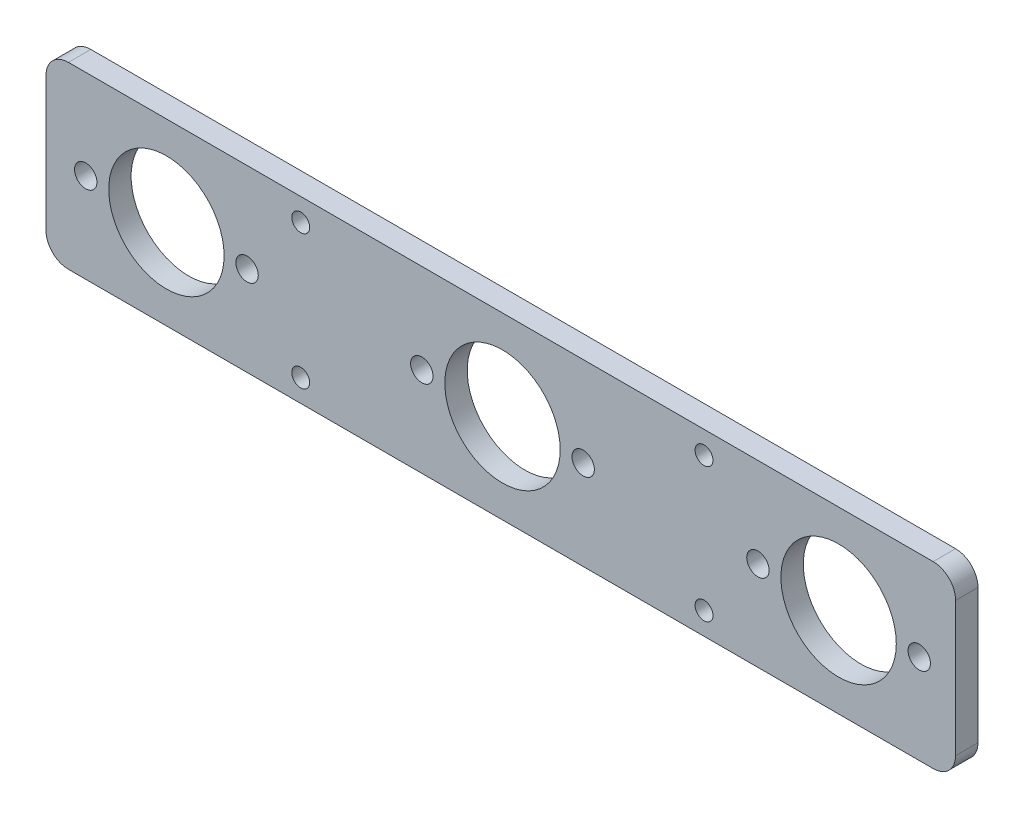
ISO-10303-21;
HEADER;
FILE_DESCRIPTION(('STEP AP214'),'2;1');
FILE_NAME('part.step','',(''),(''),'','','');
FILE_SCHEMA(('AUTOMOTIVE_DESIGN { 1 0 10303 214 1 1 1 1 }'));
ENDSEC;
DATA;
#1=APPLICATION_CONTEXT('core data for automotive mechanical design processes');
#2=APPLICATION_PROTOCOL_DEFINITION('international standard','automotive_design',2000,#1);
#3=PRODUCT_CONTEXT('',#1,'mechanical');
#4=PRODUCT('Part','Part','',(#3));
#5=PRODUCT_RELATED_PRODUCT_CATEGORY('part','',(#4));
#6=PRODUCT_DEFINITION_FORMATION('','',#4);
#7=PRODUCT_DEFINITION_CONTEXT('part definition',#1,'design');
#8=PRODUCT_DEFINITION('design','',#6,#7);
#9=PRODUCT_DEFINITION_SHAPE('','',#8);
#10=(LENGTH_UNIT() NAMED_UNIT(*) SI_UNIT(.MILLI.,.METRE.));
#11=(NAMED_UNIT(*) PLANE_ANGLE_UNIT() SI_UNIT($,.RADIAN.));
#12=(NAMED_UNIT(*) SI_UNIT($,.STERADIAN.) SOLID_ANGLE_UNIT());
#13=UNCERTAINTY_MEASURE_WITH_UNIT(LENGTH_MEASURE(1.E-05),#10,'distance_accuracy_value','');
#14=(GEOMETRIC_REPRESENTATION_CONTEXT(3) GLOBAL_UNCERTAINTY_ASSIGNED_CONTEXT((#13)) GLOBAL_UNIT_ASSIGNED_CONTEXT((#10,
#11,#12)) REPRESENTATION_CONTEXT('',''));
#15=CARTESIAN_POINT('',(0.,0.,0.));
#16=DIRECTION('',(0.,0.,1.));
#17=DIRECTION('',(1.,0.,0.));
#18=AXIS2_PLACEMENT_3D('',#15,#16,#17);
#19=CARTESIAN_POINT('',(96.5869160731503,-15.4090262093853,5.));
#20=DIRECTION('',(0.,0.,1.));
#21=DIRECTION('',(1.,0.,0.));
#22=AXIS2_PLACEMENT_3D('',#19,#20,#21);
#23=PLANE('',#22);
#24=CARTESIAN_POINT('',(45.450630342167,14.5909737906147,5.));
#25=DIRECTION('',(0.,0.,1.));
#26=DIRECTION('',(1.,0.,0.));
#27=AXIS2_PLACEMENT_3D('',#24,#25,#26);
#28=CIRCLE('',#27,2.);
#29=CARTESIAN_POINT('',(47.450630342167,14.5909737906147,5.));
#30=VERTEX_POINT('',#29);
#31=EDGE_CURVE('E242',#30,#30,#28,.T.);
#32=ORIENTED_EDGE('',*,*,#31,.F.);
#33=EDGE_LOOP('',(#32));
#34=FACE_BOUND('',#33,.T.);
#35=CARTESIAN_POINT('',(-44.5558009077748,14.5909737906147,5.));
#36=DIRECTION('',(0.,0.,1.));
#37=DIRECTION('',(1.,0.,0.));
#38=AXIS2_PLACEMENT_3D('',#35,#36,#37);
#39=CIRCLE('',#38,2.);
#40=CARTESIAN_POINT('',(-42.5558009077748,14.5909737906147,5.));
#41=VERTEX_POINT('',#40);
#42=EDGE_CURVE('E230',#41,#41,#39,.T.);
#43=ORIENTED_EDGE('',*,*,#42,.F.);
#44=EDGE_LOOP('',(#43));
#45=FACE_BOUND('',#44,.T.);
#46=CARTESIAN_POINT('',(93.4763232745663,-0.409026209385314,5.));
#47=DIRECTION('',(0.,0.,1.));
#48=DIRECTION('',(1.,0.,0.));
#49=AXIS2_PLACEMENT_3D('',#46,#47,#48);
#50=CIRCLE('',#49,2.49999999999999);
#51=CARTESIAN_POINT('',(95.9763232745663,-0.409026209385314,5.));
#52=VERTEX_POINT('',#51);
#53=EDGE_CURVE('E218',#52,#52,#50,.T.);
#54=ORIENTED_EDGE('',*,*,#53,.F.);
#55=EDGE_LOOP('',(#54));
#56=FACE_BOUND('',#55,.T.);
#57=CARTESIAN_POINT('',(-17.5236767254337,-0.409026209385321,5.));
#58=DIRECTION('',(0.,0.,1.));
#59=DIRECTION('',(-1.,0.,0.));
#60=AXIS2_PLACEMENT_3D('',#57,#58,#59);
#61=CIRCLE('',#60,2.50000000000001);
#62=CARTESIAN_POINT('',(-20.0236767254337,-0.409026209385321,5.));
#63=VERTEX_POINT('',#62);
#64=EDGE_CURVE('E206',#63,#63,#61,.T.);
#65=ORIENTED_EDGE('',*,*,#64,.F.);
#66=EDGE_LOOP('',(#65));
#67=FACE_BOUND('',#66,.T.);
#68=CARTESIAN_POINT('',(0.476323274566315,-0.409026209385321,5.));
#69=DIRECTION('',(0.,0.,1.));
#70=DIRECTION('',(1.,0.,0.));
#71=AXIS2_PLACEMENT_3D('',#68,#69,#70);
#72=CIRCLE('',#71,12.875);
#73=CARTESIAN_POINT('',(13.3513232745663,-0.409026209385321,5.));
#74=VERTEX_POINT('',#73);
#75=EDGE_CURVE('E194',#74,#74,#72,.T.);
#76=ORIENTED_EDGE('',*,*,#75,.F.);
#77=EDGE_LOOP('',(#76));
#78=FACE_BOUND('',#77,.T.);
#79=CARTESIAN_POINT('',(-56.5236767254337,-0.409026209385314,5.));
#80=DIRECTION('',(0.,0.,1.));
#81=DIRECTION('',(1.,0.,0.));
#82=AXIS2_PLACEMENT_3D('',#79,#80,#81);
#83=CIRCLE('',#82,2.49999999999999);
#84=CARTESIAN_POINT('',(-54.0236767254337,-0.409026209385314,5.));
#85=VERTEX_POINT('',#84);
#86=EDGE_CURVE('E182',#85,#85,#83,.T.);
#87=ORIENTED_EDGE('',*,*,#86,.F.);
#88=EDGE_LOOP('',(#87));
#89=FACE_BOUND('',#88,.T.);
#90=CARTESIAN_POINT('',(96.5869160731503,-15.4090262093853,5.));
#91=DIRECTION('',(0.,0.,1.));
#92=DIRECTION('',(1.,0.,0.));
#93=AXIS2_PLACEMENT_3D('',#90,#91,#92);
#94=CIRCLE('',#93,5.);
#95=CARTESIAN_POINT('',(96.5869160731503,-20.4090262093853,5.));
#96=VERTEX_POINT('',#95);
#97=CARTESIAN_POINT('',(101.58691607315,-15.4090262093853,5.));
#98=VERTEX_POINT('',#97);
#99=EDGE_CURVE('E145',#96,#98,#94,.T.);
#100=ORIENTED_EDGE('',*,*,#99,.T.);
#101=DIRECTION('',(0.,1.,0.));
#102=VECTOR('',#101,1.);
#103=CARTESIAN_POINT('',(101.58691607315,-15.4090262093853,5.));
#104=LINE('',#103,#102);
#105=CARTESIAN_POINT('',(101.58691607315,14.5909737906147,5.));
#106=VERTEX_POINT('',#105);
#107=EDGE_CURVE('E93',#98,#106,#104,.T.);
#108=ORIENTED_EDGE('',*,*,#107,.T.);
#109=CARTESIAN_POINT('',(96.5869160731503,14.5909737906147,5.));
#110=DIRECTION('',(0.,0.,1.));
#111=DIRECTION('',(1.,0.,0.));
#112=AXIS2_PLACEMENT_3D('',#109,#110,#111);
#113=CIRCLE('',#112,5.);
#114=CARTESIAN_POINT('',(96.5869160731503,19.5909737906147,5.));
#115=VERTEX_POINT('',#114);
#116=EDGE_CURVE('E160',#106,#115,#113,.T.);
#117=ORIENTED_EDGE('',*,*,#116,.T.);
#118=DIRECTION('',(-1.,0.,0.));
#119=VECTOR('',#118,1.);
#120=CARTESIAN_POINT('',(96.5869160731503,19.5909737906147,5.));
#121=LINE('',#120,#119);
#122=CARTESIAN_POINT('',(-96.3938664354803,19.5909737906147,5.));
#123=VERTEX_POINT('',#122);
#124=EDGE_CURVE('E173',#115,#123,#121,.T.);
#125=ORIENTED_EDGE('',*,*,#124,.T.);
#126=CARTESIAN_POINT('',(-96.3938664354803,14.5909737906147,5.));
#127=DIRECTION('',(0.,0.,1.));
#128=DIRECTION('',(-1.,0.,0.));
#129=AXIS2_PLACEMENT_3D('',#126,#127,#128);
#130=CIRCLE('',#129,5.);
#131=CARTESIAN_POINT('',(-101.39386643548,14.5909737906146,5.));
#132=VERTEX_POINT('',#131);
#133=EDGE_CURVE('E112',#123,#132,#130,.T.);
#134=ORIENTED_EDGE('',*,*,#133,.T.);
#135=DIRECTION('',(0.,-1.,0.));
#136=VECTOR('',#135,1.);
#137=CARTESIAN_POINT('',(-101.39386643548,14.5909737906146,5.));
#138=LINE('',#137,#136);
#139=CARTESIAN_POINT('',(-101.39386643548,-15.4090262093853,5.));
#140=VERTEX_POINT('',#139);
#141=EDGE_CURVE('E106',#132,#140,#138,.T.);
#142=ORIENTED_EDGE('',*,*,#141,.T.);
#143=CARTESIAN_POINT('',(-96.3938664354803,-15.4090262093853,5.));
#144=DIRECTION('',(0.,0.,1.));
#145=DIRECTION('',(-1.,0.,0.));
#146=AXIS2_PLACEMENT_3D('',#143,#144,#145);
#147=CIRCLE('',#146,5.);
#148=CARTESIAN_POINT('',(-96.3938664354803,-20.4090262093853,5.));
#149=VERTEX_POINT('',#148);
#150=EDGE_CURVE('E110',#140,#149,#147,.T.);
#151=ORIENTED_EDGE('',*,*,#150,.T.);
#152=DIRECTION('',(1.,0.,0.));
#153=VECTOR('',#152,1.);
#154=CARTESIAN_POINT('',(96.5869160731503,-20.4090262093853,5.));
#155=LINE('',#154,#153);
#156=EDGE_CURVE('E50',#149,#96,#155,.T.);
#157=ORIENTED_EDGE('',*,*,#156,.T.);
#158=EDGE_LOOP('',(#100,#108,#117,#125,#134,#142,#151,#157));
#159=FACE_BOUND('',#158,.T.);
#160=CARTESIAN_POINT('',(-74.5236767254337,-0.409026209385321,5.));
#161=DIRECTION('',(0.,0.,1.));
#162=DIRECTION('',(1.,0.,0.));
#163=AXIS2_PLACEMENT_3D('',#160,#161,#162);
#164=CIRCLE('',#163,12.875);
#165=CARTESIAN_POINT('',(-61.6486767254337,-0.409026209385321,5.));
#166=VERTEX_POINT('',#165);
#167=EDGE_CURVE('E134',#166,#166,#164,.T.);
#168=ORIENTED_EDGE('',*,*,#167,.F.);
#169=EDGE_LOOP('',(#168));
#170=FACE_BOUND('',#169,.T.);
#171=CARTESIAN_POINT('',(-92.5236767254337,-0.409026209385321,5.));
#172=DIRECTION('',(0.,0.,1.));
#173=DIRECTION('',(-1.,0.,0.));
#174=AXIS2_PLACEMENT_3D('',#171,#172,#173);
#175=CIRCLE('',#174,2.50000000000001);
#176=CARTESIAN_POINT('',(-95.0236767254337,-0.409026209385321,5.));
#177=VERTEX_POINT('',#176);
#178=EDGE_CURVE('E188',#177,#177,#175,.T.);
#179=ORIENTED_EDGE('',*,*,#178,.F.);
#180=EDGE_LOOP('',(#179));
#181=FACE_BOUND('',#180,.T.);
#182=CARTESIAN_POINT('',(18.4763232745663,-0.409026209385314,5.));
#183=DIRECTION('',(0.,0.,1.));
#184=DIRECTION('',(1.,0.,0.));
#185=AXIS2_PLACEMENT_3D('',#182,#183,#184);
#186=CIRCLE('',#185,2.50000000000001);
#187=CARTESIAN_POINT('',(20.9763232745663,-0.409026209385314,5.));
#188=VERTEX_POINT('',#187);
#189=EDGE_CURVE('E200',#188,#188,#186,.T.);
#190=ORIENTED_EDGE('',*,*,#189,.F.);
#191=EDGE_LOOP('',(#190));
#192=FACE_BOUND('',#191,.T.);
#193=CARTESIAN_POINT('',(75.4763232745663,-0.409026209385321,5.));
#194=DIRECTION('',(0.,0.,1.));
#195=DIRECTION('',(1.,0.,0.));
#196=AXIS2_PLACEMENT_3D('',#193,#194,#195);
#197=CIRCLE('',#196,12.875);
#198=CARTESIAN_POINT('',(88.3513232745663,-0.409026209385321,5.));
#199=VERTEX_POINT('',#198);
#200=EDGE_CURVE('E212',#199,#199,#197,.T.);
#201=ORIENTED_EDGE('',*,*,#200,.F.);
#202=EDGE_LOOP('',(#201));
#203=FACE_BOUND('',#202,.T.);
#204=CARTESIAN_POINT('',(57.4763232745663,-0.409026209385321,5.));
#205=DIRECTION('',(0.,0.,1.));
#206=DIRECTION('',(-1.,0.,0.));
#207=AXIS2_PLACEMENT_3D('',#204,#205,#206);
#208=CIRCLE('',#207,2.50000000000001);
#209=CARTESIAN_POINT('',(54.9763232745663,-0.409026209385321,5.));
#210=VERTEX_POINT('',#209);
#211=EDGE_CURVE('E224',#210,#210,#208,.T.);
#212=ORIENTED_EDGE('',*,*,#211,.F.);
#213=EDGE_LOOP('',(#212));
#214=FACE_BOUND('',#213,.T.);
#215=CARTESIAN_POINT('',(-44.5558009077748,-15.4090262093853,5.));
#216=DIRECTION('',(0.,0.,1.));
#217=DIRECTION('',(1.,0.,0.));
#218=AXIS2_PLACEMENT_3D('',#215,#216,#217);
#219=CIRCLE('',#218,2.);
#220=CARTESIAN_POINT('',(-42.5558009077748,-15.4090262093853,5.));
#221=VERTEX_POINT('',#220);
#222=EDGE_CURVE('E236',#221,#221,#219,.T.);
#223=ORIENTED_EDGE('',*,*,#222,.F.);
#224=EDGE_LOOP('',(#223));
#225=FACE_BOUND('',#224,.T.);
#226=CARTESIAN_POINT('',(45.450630342167,-15.4090262093853,5.));
#227=DIRECTION('',(0.,0.,1.));
#228=DIRECTION('',(1.,0.,0.));
#229=AXIS2_PLACEMENT_3D('',#226,#227,#228);
#230=CIRCLE('',#229,2.);
#231=CARTESIAN_POINT('',(47.450630342167,-15.4090262093853,5.));
#232=VERTEX_POINT('',#231);
#233=EDGE_CURVE('E248',#232,#232,#230,.T.);
#234=ORIENTED_EDGE('',*,*,#233,.F.);
#235=EDGE_LOOP('',(#234));
#236=FACE_BOUND('',#235,.T.);
#237=ADVANCED_FACE('F33',(#34,#45,#56,#67,#78,#89,#159,#170,#181,#192,#203,#214,#225,#236),#23,.T.);
#238=CARTESIAN_POINT('',(96.5869160731503,-15.4090262093853,0.));
#239=DIRECTION('',(0.,0.,1.));
#240=DIRECTION('',(1.,0.,0.));
#241=AXIS2_PLACEMENT_3D('',#238,#239,#240);
#242=PLANE('',#241);
#243=CARTESIAN_POINT('',(96.5869160731503,-15.4090262093853,0.));
#244=DIRECTION('',(0.,0.,1.));
#245=DIRECTION('',(1.,0.,0.));
#246=AXIS2_PLACEMENT_3D('',#243,#244,#245);
#247=CIRCLE('',#246,5.);
#248=CARTESIAN_POINT('',(96.5869160731503,-20.4090262093853,0.));
#249=VERTEX_POINT('',#248);
#250=CARTESIAN_POINT('',(101.58691607315,-15.4090262093853,0.));
#251=VERTEX_POINT('',#250);
#252=EDGE_CURVE('E130',#249,#251,#247,.T.);
#253=ORIENTED_EDGE('',*,*,#252,.F.);
#254=DIRECTION('',(1.,0.,0.));
#255=VECTOR('',#254,1.);
#256=CARTESIAN_POINT('',(96.5869160731503,-20.4090262093853,0.));
#257=LINE('',#256,#255);
#258=CARTESIAN_POINT('',(-96.3938664354803,-20.4090262093853,0.));
#259=VERTEX_POINT('',#258);
#260=EDGE_CURVE('E85',#259,#249,#257,.T.);
#261=ORIENTED_EDGE('',*,*,#260,.F.);
#262=CARTESIAN_POINT('',(-96.3938664354803,-15.4090262093853,0.));
#263=DIRECTION('',(0.,0.,1.));
#264=DIRECTION('',(-1.,0.,0.));
#265=AXIS2_PLACEMENT_3D('',#262,#263,#264);
#266=CIRCLE('',#265,5.);
#267=CARTESIAN_POINT('',(-101.39386643548,-15.4090262093853,0.));
#268=VERTEX_POINT('',#267);
#269=EDGE_CURVE('E79',#268,#259,#266,.T.);
#270=ORIENTED_EDGE('',*,*,#269,.F.);
#271=DIRECTION('',(0.,-1.,0.));
#272=VECTOR('',#271,1.);
#273=CARTESIAN_POINT('',(-101.39386643548,14.5909737906146,0.));
#274=LINE('',#273,#272);
#275=CARTESIAN_POINT('',(-101.39386643548,14.5909737906146,0.));
#276=VERTEX_POINT('',#275);
#277=EDGE_CURVE('E120',#276,#268,#274,.T.);
#278=ORIENTED_EDGE('',*,*,#277,.F.);
#279=CARTESIAN_POINT('',(-96.3938664354803,14.5909737906147,0.));
#280=DIRECTION('',(0.,0.,1.));
#281=DIRECTION('',(-1.,0.,0.));
#282=AXIS2_PLACEMENT_3D('',#279,#280,#281);
#283=CIRCLE('',#282,5.);
#284=CARTESIAN_POINT('',(-96.3938664354803,19.5909737906147,0.));
#285=VERTEX_POINT('',#284);
#286=EDGE_CURVE('E140',#285,#276,#283,.T.);
#287=ORIENTED_EDGE('',*,*,#286,.F.);
#288=DIRECTION('',(-1.,0.,0.));
#289=VECTOR('',#288,1.);
#290=CARTESIAN_POINT('',(96.5869160731503,19.5909737906147,0.));
#291=LINE('',#290,#289);
#292=CARTESIAN_POINT('',(96.5869160731503,19.5909737906147,0.));
#293=VERTEX_POINT('',#292);
#294=EDGE_CURVE('E138',#293,#285,#291,.T.);
#295=ORIENTED_EDGE('',*,*,#294,.F.);
#296=CARTESIAN_POINT('',(96.5869160731503,14.5909737906147,0.));
#297=DIRECTION('',(0.,0.,1.));
#298=DIRECTION('',(1.,0.,0.));
#299=AXIS2_PLACEMENT_3D('',#296,#297,#298);
#300=CIRCLE('',#299,5.);
#301=CARTESIAN_POINT('',(101.58691607315,14.5909737906147,0.));
#302=VERTEX_POINT('',#301);
#303=EDGE_CURVE('E136',#302,#293,#300,.T.);
#304=ORIENTED_EDGE('',*,*,#303,.F.);
#305=DIRECTION('',(0.,1.,0.));
#306=VECTOR('',#305,1.);
#307=CARTESIAN_POINT('',(101.58691607315,-15.4090262093853,0.));
#308=LINE('',#307,#306);
#309=EDGE_CURVE('E133',#251,#302,#308,.T.);
#310=ORIENTED_EDGE('',*,*,#309,.F.);
#311=EDGE_LOOP('',(#253,#261,#270,#278,#287,#295,#304,#310));
#312=FACE_BOUND('',#311,.T.);
#313=CARTESIAN_POINT('',(-74.5236767254337,-0.409026209385321,0.));
#314=DIRECTION('',(0.,0.,1.));
#315=DIRECTION('',(1.,0.,0.));
#316=AXIS2_PLACEMENT_3D('',#313,#314,#315);
#317=CIRCLE('',#316,12.875);
#318=CARTESIAN_POINT('',(-61.6486767254337,-0.409026209385321,0.));
#319=VERTEX_POINT('',#318);
#320=EDGE_CURVE('E179',#319,#319,#317,.T.);
#321=ORIENTED_EDGE('',*,*,#320,.T.);
#322=EDGE_LOOP('',(#321));
#323=FACE_BOUND('',#322,.T.);
#324=CARTESIAN_POINT('',(-56.5236767254337,-0.409026209385314,0.));
#325=DIRECTION('',(0.,0.,1.));
#326=DIRECTION('',(1.,0.,0.));
#327=AXIS2_PLACEMENT_3D('',#324,#325,#326);
#328=CIRCLE('',#327,2.49999999999999);
#329=CARTESIAN_POINT('',(-54.0236767254337,-0.409026209385314,0.));
#330=VERTEX_POINT('',#329);
#331=EDGE_CURVE('E185',#330,#330,#328,.T.);
#332=ORIENTED_EDGE('',*,*,#331,.T.);
#333=EDGE_LOOP('',(#332));
#334=FACE_BOUND('',#333,.T.);
#335=CARTESIAN_POINT('',(-92.5236767254337,-0.409026209385321,0.));
#336=DIRECTION('',(0.,0.,1.));
#337=DIRECTION('',(-1.,0.,0.));
#338=AXIS2_PLACEMENT_3D('',#335,#336,#337);
#339=CIRCLE('',#338,2.50000000000001);
#340=CARTESIAN_POINT('',(-95.0236767254337,-0.409026209385321,0.));
#341=VERTEX_POINT('',#340);
#342=EDGE_CURVE('E191',#341,#341,#339,.T.);
#343=ORIENTED_EDGE('',*,*,#342,.T.);
#344=EDGE_LOOP('',(#343));
#345=FACE_BOUND('',#344,.T.);
#346=CARTESIAN_POINT('',(0.476323274566315,-0.409026209385321,0.));
#347=DIRECTION('',(0.,0.,1.));
#348=DIRECTION('',(1.,0.,0.));
#349=AXIS2_PLACEMENT_3D('',#346,#347,#348);
#350=CIRCLE('',#349,12.875);
#351=CARTESIAN_POINT('',(13.3513232745663,-0.409026209385321,0.));
#352=VERTEX_POINT('',#351);
#353=EDGE_CURVE('E197',#352,#352,#350,.T.);
#354=ORIENTED_EDGE('',*,*,#353,.T.);
#355=EDGE_LOOP('',(#354));
#356=FACE_BOUND('',#355,.T.);
#357=CARTESIAN_POINT('',(18.4763232745663,-0.409026209385314,0.));
#358=DIRECTION('',(0.,0.,1.));
#359=DIRECTION('',(1.,0.,0.));
#360=AXIS2_PLACEMENT_3D('',#357,#358,#359);
#361=CIRCLE('',#360,2.50000000000001);
#362=CARTESIAN_POINT('',(20.9763232745663,-0.409026209385314,0.));
#363=VERTEX_POINT('',#362);
#364=EDGE_CURVE('E203',#363,#363,#361,.T.);
#365=ORIENTED_EDGE('',*,*,#364,.T.);
#366=EDGE_LOOP('',(#365));
#367=FACE_BOUND('',#366,.T.);
#368=CARTESIAN_POINT('',(-17.5236767254337,-0.409026209385321,0.));
#369=DIRECTION('',(0.,0.,1.));
#370=DIRECTION('',(-1.,0.,0.));
#371=AXIS2_PLACEMENT_3D('',#368,#369,#370);
#372=CIRCLE('',#371,2.50000000000001);
#373=CARTESIAN_POINT('',(-20.0236767254337,-0.409026209385321,0.));
#374=VERTEX_POINT('',#373);
#375=EDGE_CURVE('E209',#374,#374,#372,.T.);
#376=ORIENTED_EDGE('',*,*,#375,.T.);
#377=EDGE_LOOP('',(#376));
#378=FACE_BOUND('',#377,.T.);
#379=CARTESIAN_POINT('',(75.4763232745663,-0.409026209385321,0.));
#380=DIRECTION('',(0.,0.,1.));
#381=DIRECTION('',(1.,0.,0.));
#382=AXIS2_PLACEMENT_3D('',#379,#380,#381);
#383=CIRCLE('',#382,12.875);
#384=CARTESIAN_POINT('',(88.3513232745663,-0.409026209385321,0.));
#385=VERTEX_POINT('',#384);
#386=EDGE_CURVE('E215',#385,#385,#383,.T.);
#387=ORIENTED_EDGE('',*,*,#386,.T.);
#388=EDGE_LOOP('',(#387));
#389=FACE_BOUND('',#388,.T.);
#390=CARTESIAN_POINT('',(93.4763232745663,-0.409026209385314,0.));
#391=DIRECTION('',(0.,0.,1.));
#392=DIRECTION('',(1.,0.,0.));
#393=AXIS2_PLACEMENT_3D('',#390,#391,#392);
#394=CIRCLE('',#393,2.49999999999999);
#395=CARTESIAN_POINT('',(95.9763232745663,-0.409026209385314,0.));
#396=VERTEX_POINT('',#395);
#397=EDGE_CURVE('E221',#396,#396,#394,.T.);
#398=ORIENTED_EDGE('',*,*,#397,.T.);
#399=EDGE_LOOP('',(#398));
#400=FACE_BOUND('',#399,.T.);
#401=CARTESIAN_POINT('',(57.4763232745663,-0.409026209385321,0.));
#402=DIRECTION('',(0.,0.,1.));
#403=DIRECTION('',(-1.,0.,0.));
#404=AXIS2_PLACEMENT_3D('',#401,#402,#403);
#405=CIRCLE('',#404,2.50000000000001);
#406=CARTESIAN_POINT('',(54.9763232745663,-0.409026209385321,0.));
#407=VERTEX_POINT('',#406);
#408=EDGE_CURVE('E227',#407,#407,#405,.T.);
#409=ORIENTED_EDGE('',*,*,#408,.T.);
#410=EDGE_LOOP('',(#409));
#411=FACE_BOUND('',#410,.T.);
#412=CARTESIAN_POINT('',(-44.5558009077748,14.5909737906147,0.));
#413=DIRECTION('',(0.,0.,1.));
#414=DIRECTION('',(1.,0.,0.));
#415=AXIS2_PLACEMENT_3D('',#412,#413,#414);
#416=CIRCLE('',#415,2.);
#417=CARTESIAN_POINT('',(-42.5558009077748,14.5909737906147,0.));
#418=VERTEX_POINT('',#417);
#419=EDGE_CURVE('E233',#418,#418,#416,.T.);
#420=ORIENTED_EDGE('',*,*,#419,.T.);
#421=EDGE_LOOP('',(#420));
#422=FACE_BOUND('',#421,.T.);
#423=CARTESIAN_POINT('',(-44.5558009077748,-15.4090262093853,0.));
#424=DIRECTION('',(0.,0.,1.));
#425=DIRECTION('',(1.,0.,0.));
#426=AXIS2_PLACEMENT_3D('',#423,#424,#425);
#427=CIRCLE('',#426,2.);
#428=CARTESIAN_POINT('',(-42.5558009077748,-15.4090262093853,0.));
#429=VERTEX_POINT('',#428);
#430=EDGE_CURVE('E239',#429,#429,#427,.T.);
#431=ORIENTED_EDGE('',*,*,#430,.T.);
#432=EDGE_LOOP('',(#431));
#433=FACE_BOUND('',#432,.T.);
#434=CARTESIAN_POINT('',(45.450630342167,14.5909737906147,0.));
#435=DIRECTION('',(0.,0.,1.));
#436=DIRECTION('',(1.,0.,0.));
#437=AXIS2_PLACEMENT_3D('',#434,#435,#436);
#438=CIRCLE('',#437,2.);
#439=CARTESIAN_POINT('',(47.450630342167,14.5909737906147,0.));
#440=VERTEX_POINT('',#439);
#441=EDGE_CURVE('E245',#440,#440,#438,.T.);
#442=ORIENTED_EDGE('',*,*,#441,.T.);
#443=EDGE_LOOP('',(#442));
#444=FACE_BOUND('',#443,.T.);
#445=CARTESIAN_POINT('',(45.450630342167,-15.4090262093853,0.));
#446=DIRECTION('',(0.,0.,1.));
#447=DIRECTION('',(1.,0.,0.));
#448=AXIS2_PLACEMENT_3D('',#445,#446,#447);
#449=CIRCLE('',#448,2.);
#450=CARTESIAN_POINT('',(47.450630342167,-15.4090262093853,0.));
#451=VERTEX_POINT('',#450);
#452=EDGE_CURVE('E251',#451,#451,#449,.T.);
#453=ORIENTED_EDGE('',*,*,#452,.T.);
#454=EDGE_LOOP('',(#453));
#455=FACE_BOUND('',#454,.T.);
#456=ADVANCED_FACE('F164',(#312,#323,#334,#345,#356,#367,#378,#389,#400,#411,#422,#433,#444,
#455),#242,.F.);
#457=CARTESIAN_POINT('',(96.5869160731503,-15.4090262093853,5.));
#458=DIRECTION('',(0.,0.,-1.));
#459=DIRECTION('',(-1.,0.,0.));
#460=AXIS2_PLACEMENT_3D('',#457,#458,#459);
#461=CYLINDRICAL_SURFACE('',#460,5.);
#462=ORIENTED_EDGE('',*,*,#252,.T.);
#463=DIRECTION('',(0.,0.,-1.));
#464=VECTOR('',#463,1.);
#465=CARTESIAN_POINT('',(101.58691607315,-15.4090262093853,5.));
#466=LINE('',#465,#464);
#467=EDGE_CURVE('E11',#98,#251,#466,.T.);
#468=ORIENTED_EDGE('',*,*,#467,.F.);
#469=ORIENTED_EDGE('',*,*,#99,.F.);
#470=DIRECTION('',(0.,0.,-1.));
#471=VECTOR('',#470,1.);
#472=CARTESIAN_POINT('',(96.5869160731503,-20.4090262093853,5.));
#473=LINE('',#472,#471);
#474=EDGE_CURVE('E126',#96,#249,#473,.T.);
#475=ORIENTED_EDGE('',*,*,#474,.T.);
#476=EDGE_LOOP('',(#462,#468,#469,#475));
#477=FACE_BOUND('',#476,.T.);
#478=ADVANCED_FACE('F35',(#477),#461,.T.);
#479=CARTESIAN_POINT('',(101.58691607315,-15.4090262093853,5.));
#480=DIRECTION('',(-1.,0.,0.));
#481=DIRECTION('',(0.,0.,1.));
#482=AXIS2_PLACEMENT_3D('',#479,#480,#481);
#483=PLANE('',#482);
#484=ORIENTED_EDGE('',*,*,#309,.T.);
#485=DIRECTION('',(0.,0.,-1.));
#486=VECTOR('',#485,1.);
#487=CARTESIAN_POINT('',(101.58691607315,14.5909737906147,5.));
#488=LINE('',#487,#486);
#489=EDGE_CURVE('E42',#106,#302,#488,.T.);
#490=ORIENTED_EDGE('',*,*,#489,.F.);
#491=ORIENTED_EDGE('',*,*,#107,.F.);
#492=ORIENTED_EDGE('',*,*,#467,.T.);
#493=EDGE_LOOP('',(#484,#490,#491,#492));
#494=FACE_BOUND('',#493,.T.);
#495=ADVANCED_FACE('F285',(#494),#483,.F.);
#496=CARTESIAN_POINT('',(96.5869160731503,14.5909737906147,5.));
#497=DIRECTION('',(0.,0.,-1.));
#498=DIRECTION('',(-1.,0.,0.));
#499=AXIS2_PLACEMENT_3D('',#496,#497,#498);
#500=CYLINDRICAL_SURFACE('',#499,5.);
#501=ORIENTED_EDGE('',*,*,#303,.T.);
#502=DIRECTION('',(0.,0.,-1.));
#503=VECTOR('',#502,1.);
#504=CARTESIAN_POINT('',(96.5869160731503,19.5909737906147,5.));
#505=LINE('',#504,#503);
#506=EDGE_CURVE('E152',#115,#293,#505,.T.);
#507=ORIENTED_EDGE('',*,*,#506,.F.);
#508=ORIENTED_EDGE('',*,*,#116,.F.);
#509=ORIENTED_EDGE('',*,*,#489,.T.);
#510=EDGE_LOOP('',(#501,#507,#508,#509));
#511=FACE_BOUND('',#510,.T.);
#512=ADVANCED_FACE('F158',(#511),#500,.T.);
#513=CARTESIAN_POINT('',(96.5869160731503,19.5909737906147,5.));
#514=DIRECTION('',(0.,-1.,0.));
#515=DIRECTION('',(1.,0.,0.));
#516=AXIS2_PLACEMENT_3D('',#513,#514,#515);
#517=PLANE('',#516);
#518=ORIENTED_EDGE('',*,*,#294,.T.);
#519=DIRECTION('',(0.,0.,-1.));
#520=VECTOR('',#519,1.);
#521=CARTESIAN_POINT('',(-96.3938664354803,19.5909737906147,5.));
#522=LINE('',#521,#520);
#523=EDGE_CURVE('E149',#123,#285,#522,.T.);
#524=ORIENTED_EDGE('',*,*,#523,.F.);
#525=ORIENTED_EDGE('',*,*,#124,.F.);
#526=ORIENTED_EDGE('',*,*,#506,.T.);
#527=EDGE_LOOP('',(#518,#524,#525,#526));
#528=FACE_BOUND('',#527,.T.);
#529=ADVANCED_FACE('F169',(#528),#517,.F.);
#530=CARTESIAN_POINT('',(-96.3938664354803,14.5909737906147,5.));
#531=DIRECTION('',(0.,0.,-1.));
#532=DIRECTION('',(-1.,0.,0.));
#533=AXIS2_PLACEMENT_3D('',#530,#531,#532);
#534=CYLINDRICAL_SURFACE('',#533,5.);
#535=ORIENTED_EDGE('',*,*,#286,.T.);
#536=DIRECTION('',(0.,0.,-1.));
#537=VECTOR('',#536,1.);
#538=CARTESIAN_POINT('',(-101.39386643548,14.5909737906146,5.));
#539=LINE('',#538,#537);
#540=EDGE_CURVE('E121',#132,#276,#539,.T.);
#541=ORIENTED_EDGE('',*,*,#540,.F.);
#542=ORIENTED_EDGE('',*,*,#133,.F.);
#543=ORIENTED_EDGE('',*,*,#523,.T.);
#544=EDGE_LOOP('',(#535,#541,#542,#543));
#545=FACE_BOUND('',#544,.T.);
#546=ADVANCED_FACE('F172',(#545),#534,.T.);
#547=CARTESIAN_POINT('',(-101.39386643548,14.5909737906146,5.));
#548=DIRECTION('',(1.,0.,0.));
#549=DIRECTION('',(0.,0.,-1.));
#550=AXIS2_PLACEMENT_3D('',#547,#548,#549);
#551=PLANE('',#550);
#552=ORIENTED_EDGE('',*,*,#277,.T.);
#553=DIRECTION('',(0.,0.,-1.));
#554=VECTOR('',#553,1.);
#555=CARTESIAN_POINT('',(-101.39386643548,-15.4090262093853,5.));
#556=LINE('',#555,#554);
#557=EDGE_CURVE('E117',#140,#268,#556,.T.);
#558=ORIENTED_EDGE('',*,*,#557,.F.);
#559=ORIENTED_EDGE('',*,*,#141,.F.);
#560=ORIENTED_EDGE('',*,*,#540,.T.);
#561=EDGE_LOOP('',(#552,#558,#559,#560));
#562=FACE_BOUND('',#561,.T.);
#563=ADVANCED_FACE('F118',(#562),#551,.F.);
#564=CARTESIAN_POINT('',(-96.3938664354803,-15.4090262093853,5.));
#565=DIRECTION('',(0.,0.,-1.));
#566=DIRECTION('',(-1.,0.,0.));
#567=AXIS2_PLACEMENT_3D('',#564,#565,#566);
#568=CYLINDRICAL_SURFACE('',#567,5.);
#569=ORIENTED_EDGE('',*,*,#269,.T.);
#570=DIRECTION('',(0.,0.,-1.));
#571=VECTOR('',#570,1.);
#572=CARTESIAN_POINT('',(-96.3938664354803,-20.4090262093853,5.));
#573=LINE('',#572,#571);
#574=EDGE_CURVE('E122',#149,#259,#573,.T.);
#575=ORIENTED_EDGE('',*,*,#574,.F.);
#576=ORIENTED_EDGE('',*,*,#150,.F.);
#577=ORIENTED_EDGE('',*,*,#557,.T.);
#578=EDGE_LOOP('',(#569,#575,#576,#577));
#579=FACE_BOUND('',#578,.T.);
#580=ADVANCED_FACE('F124',(#579),#568,.T.);
#581=CARTESIAN_POINT('',(96.5869160731503,-20.4090262093853,5.));
#582=DIRECTION('',(0.,1.,0.));
#583=DIRECTION('',(-1.,0.,0.));
#584=AXIS2_PLACEMENT_3D('',#581,#582,#583);
#585=PLANE('',#584);
#586=ORIENTED_EDGE('',*,*,#260,.T.);
#587=ORIENTED_EDGE('',*,*,#474,.F.);
#588=ORIENTED_EDGE('',*,*,#156,.F.);
#589=ORIENTED_EDGE('',*,*,#574,.T.);
#590=EDGE_LOOP('',(#586,#587,#588,#589));
#591=FACE_BOUND('',#590,.T.);
#592=ADVANCED_FACE('F273',(#591),#585,.F.);
#593=CARTESIAN_POINT('',(-74.5236767254337,-0.409026209385321,5.));
#594=DIRECTION('',(0.,0.,-1.));
#595=DIRECTION('',(-1.,0.,0.));
#596=AXIS2_PLACEMENT_3D('',#593,#594,#595);
#597=CYLINDRICAL_SURFACE('',#596,12.875);
#598=ORIENTED_EDGE('',*,*,#167,.T.);
#599=EDGE_LOOP('',(#598));
#600=FACE_BOUND('',#599,.T.);
#601=ORIENTED_EDGE('',*,*,#320,.F.);
#602=EDGE_LOOP('',(#601));
#603=FACE_BOUND('',#602,.T.);
#604=ADVANCED_FACE('F270',(#600,#603),#597,.F.);
#605=CARTESIAN_POINT('',(-56.5236767254337,-0.409026209385314,5.));
#606=DIRECTION('',(0.,0.,-1.));
#607=DIRECTION('',(-1.,0.,0.));
#608=AXIS2_PLACEMENT_3D('',#605,#606,#607);
#609=CYLINDRICAL_SURFACE('',#608,2.49999999999999);
#610=ORIENTED_EDGE('',*,*,#86,.T.);
#611=EDGE_LOOP('',(#610));
#612=FACE_BOUND('',#611,.T.);
#613=ORIENTED_EDGE('',*,*,#331,.F.);
#614=EDGE_LOOP('',(#613));
#615=FACE_BOUND('',#614,.T.);
#616=ADVANCED_FACE('F349',(#612,#615),#609,.F.);
#617=CARTESIAN_POINT('',(-92.5236767254337,-0.409026209385321,5.));
#618=DIRECTION('',(0.,0.,-1.));
#619=DIRECTION('',(-1.,0.,0.));
#620=AXIS2_PLACEMENT_3D('',#617,#618,#619);
#621=CYLINDRICAL_SURFACE('',#620,2.50000000000001);
#622=ORIENTED_EDGE('',*,*,#178,.T.);
#623=EDGE_LOOP('',(#622));
#624=FACE_BOUND('',#623,.T.);
#625=ORIENTED_EDGE('',*,*,#342,.F.);
#626=EDGE_LOOP('',(#625));
#627=FACE_BOUND('',#626,.T.);
#628=ADVANCED_FACE('F357',(#624,#627),#621,.F.);
#629=CARTESIAN_POINT('',(0.476323274566315,-0.409026209385321,5.));
#630=DIRECTION('',(0.,0.,-1.));
#631=DIRECTION('',(-1.,0.,0.));
#632=AXIS2_PLACEMENT_3D('',#629,#630,#631);
#633=CYLINDRICAL_SURFACE('',#632,12.875);
#634=ORIENTED_EDGE('',*,*,#75,.T.);
#635=EDGE_LOOP('',(#634));
#636=FACE_BOUND('',#635,.T.);
#637=ORIENTED_EDGE('',*,*,#353,.F.);
#638=EDGE_LOOP('',(#637));
#639=FACE_BOUND('',#638,.T.);
#640=ADVANCED_FACE('F365',(#636,#639),#633,.F.);
#641=CARTESIAN_POINT('',(18.4763232745663,-0.409026209385314,5.));
#642=DIRECTION('',(0.,0.,-1.));
#643=DIRECTION('',(-1.,0.,0.));
#644=AXIS2_PLACEMENT_3D('',#641,#642,#643);
#645=CYLINDRICAL_SURFACE('',#644,2.50000000000001);
#646=ORIENTED_EDGE('',*,*,#189,.T.);
#647=EDGE_LOOP('',(#646));
#648=FACE_BOUND('',#647,.T.);
#649=ORIENTED_EDGE('',*,*,#364,.F.);
#650=EDGE_LOOP('',(#649));
#651=FACE_BOUND('',#650,.T.);
#652=ADVANCED_FACE('F374',(#648,#651),#645,.F.);
#653=CARTESIAN_POINT('',(-17.5236767254337,-0.409026209385321,5.));
#654=DIRECTION('',(0.,0.,-1.));
#655=DIRECTION('',(-1.,0.,0.));
#656=AXIS2_PLACEMENT_3D('',#653,#654,#655);
#657=CYLINDRICAL_SURFACE('',#656,2.50000000000001);
#658=ORIENTED_EDGE('',*,*,#64,.T.);
#659=EDGE_LOOP('',(#658));
#660=FACE_BOUND('',#659,.T.);
#661=ORIENTED_EDGE('',*,*,#375,.F.);
#662=EDGE_LOOP('',(#661));
#663=FACE_BOUND('',#662,.T.);
#664=ADVANCED_FACE('F383',(#660,#663),#657,.F.);
#665=CARTESIAN_POINT('',(75.4763232745663,-0.409026209385321,5.));
#666=DIRECTION('',(0.,0.,-1.));
#667=DIRECTION('',(-1.,0.,0.));
#668=AXIS2_PLACEMENT_3D('',#665,#666,#667);
#669=CYLINDRICAL_SURFACE('',#668,12.875);
#670=ORIENTED_EDGE('',*,*,#200,.T.);
#671=EDGE_LOOP('',(#670));
#672=FACE_BOUND('',#671,.T.);
#673=ORIENTED_EDGE('',*,*,#386,.F.);
#674=EDGE_LOOP('',(#673));
#675=FACE_BOUND('',#674,.T.);
#676=ADVANCED_FACE('F392',(#672,#675),#669,.F.);
#677=CARTESIAN_POINT('',(93.4763232745663,-0.409026209385314,5.));
#678=DIRECTION('',(0.,0.,-1.));
#679=DIRECTION('',(-1.,0.,0.));
#680=AXIS2_PLACEMENT_3D('',#677,#678,#679);
#681=CYLINDRICAL_SURFACE('',#680,2.49999999999999);
#682=ORIENTED_EDGE('',*,*,#53,.T.);
#683=EDGE_LOOP('',(#682));
#684=FACE_BOUND('',#683,.T.);
#685=ORIENTED_EDGE('',*,*,#397,.F.);
#686=EDGE_LOOP('',(#685));
#687=FACE_BOUND('',#686,.T.);
#688=ADVANCED_FACE('F401',(#684,#687),#681,.F.);
#689=CARTESIAN_POINT('',(57.4763232745663,-0.409026209385321,5.));
#690=DIRECTION('',(0.,0.,-1.));
#691=DIRECTION('',(-1.,0.,0.));
#692=AXIS2_PLACEMENT_3D('',#689,#690,#691);
#693=CYLINDRICAL_SURFACE('',#692,2.50000000000001);
#694=ORIENTED_EDGE('',*,*,#211,.T.);
#695=EDGE_LOOP('',(#694));
#696=FACE_BOUND('',#695,.T.);
#697=ORIENTED_EDGE('',*,*,#408,.F.);
#698=EDGE_LOOP('',(#697));
#699=FACE_BOUND('',#698,.T.);
#700=ADVANCED_FACE('F410',(#696,#699),#693,.F.);
#701=CARTESIAN_POINT('',(-44.5558009077748,14.5909737906147,5.));
#702=DIRECTION('',(0.,0.,-1.));
#703=DIRECTION('',(-1.,0.,0.));
#704=AXIS2_PLACEMENT_3D('',#701,#702,#703);
#705=CYLINDRICAL_SURFACE('',#704,2.);
#706=ORIENTED_EDGE('',*,*,#42,.T.);
#707=EDGE_LOOP('',(#706));
#708=FACE_BOUND('',#707,.T.);
#709=ORIENTED_EDGE('',*,*,#419,.F.);
#710=EDGE_LOOP('',(#709));
#711=FACE_BOUND('',#710,.T.);
#712=ADVANCED_FACE('F419',(#708,#711),#705,.F.);
#713=CARTESIAN_POINT('',(-44.5558009077748,-15.4090262093853,5.));
#714=DIRECTION('',(0.,0.,-1.));
#715=DIRECTION('',(-1.,0.,0.));
#716=AXIS2_PLACEMENT_3D('',#713,#714,#715);
#717=CYLINDRICAL_SURFACE('',#716,2.);
#718=ORIENTED_EDGE('',*,*,#222,.T.);
#719=EDGE_LOOP('',(#718));
#720=FACE_BOUND('',#719,.T.);
#721=ORIENTED_EDGE('',*,*,#430,.F.);
#722=EDGE_LOOP('',(#721));
#723=FACE_BOUND('',#722,.T.);
#724=ADVANCED_FACE('F428',(#720,#723),#717,.F.);
#725=CARTESIAN_POINT('',(45.450630342167,14.5909737906147,5.));
#726=DIRECTION('',(0.,0.,-1.));
#727=DIRECTION('',(-1.,0.,0.));
#728=AXIS2_PLACEMENT_3D('',#725,#726,#727);
#729=CYLINDRICAL_SURFACE('',#728,2.);
#730=ORIENTED_EDGE('',*,*,#31,.T.);
#731=EDGE_LOOP('',(#730));
#732=FACE_BOUND('',#731,.T.);
#733=ORIENTED_EDGE('',*,*,#441,.F.);
#734=EDGE_LOOP('',(#733));
#735=FACE_BOUND('',#734,.T.);
#736=ADVANCED_FACE('F437',(#732,#735),#729,.F.);
#737=CARTESIAN_POINT('',(45.450630342167,-15.4090262093853,5.));
#738=DIRECTION('',(0.,0.,-1.));
#739=DIRECTION('',(-1.,0.,0.));
#740=AXIS2_PLACEMENT_3D('',#737,#738,#739);
#741=CYLINDRICAL_SURFACE('',#740,2.);
#742=ORIENTED_EDGE('',*,*,#233,.T.);
#743=EDGE_LOOP('',(#742));
#744=FACE_BOUND('',#743,.T.);
#745=ORIENTED_EDGE('',*,*,#452,.F.);
#746=EDGE_LOOP('',(#745));
#747=FACE_BOUND('',#746,.T.);
#748=ADVANCED_FACE('F257',(#744,#747),#741,.F.);
#749=CLOSED_SHELL('',(#237,#456,#478,#495,#512,#529,#546,#563,#580,#592,#604,#616,#628,#640,
#652,#664,#676,#688,#700,#712,#724,#736,#748));
#750=MANIFOLD_SOLID_BREP('B2',#749);
#751=ADVANCED_BREP_SHAPE_REPRESENTATION('',(#18,#750),#14);
#752=SHAPE_DEFINITION_REPRESENTATION(#9,#751);
ENDSEC;
END-ISO-10303-21;
